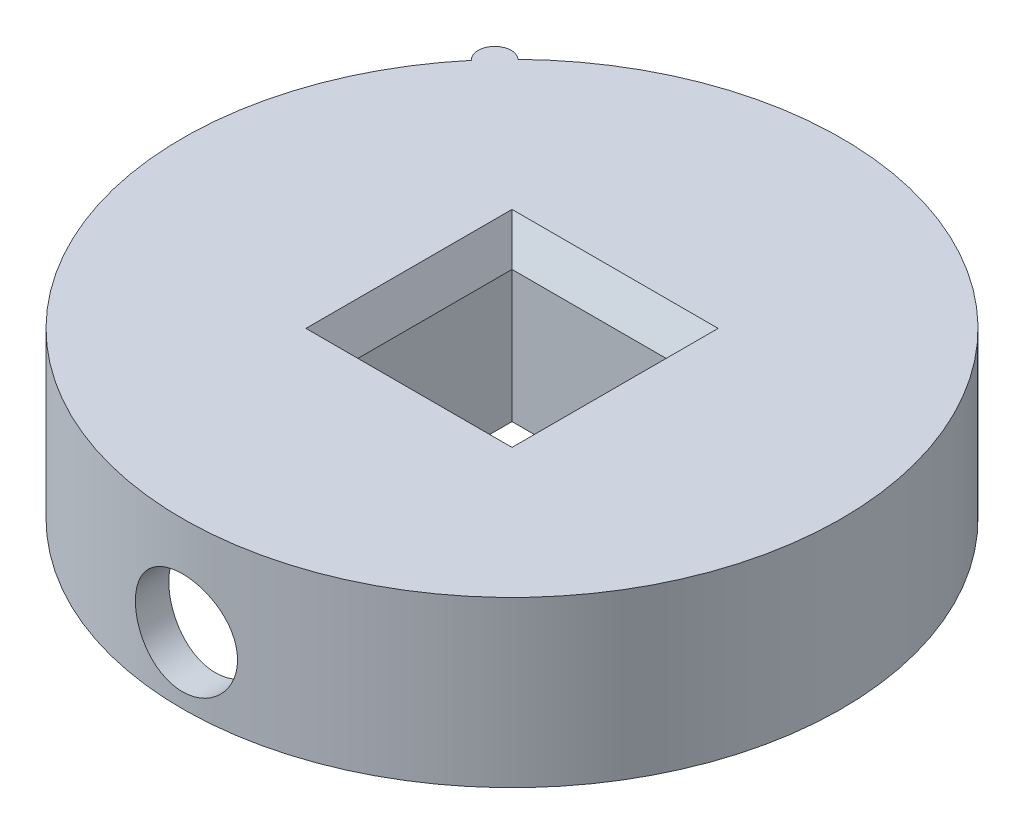
ISO-10303-21;
HEADER;
FILE_DESCRIPTION(('STEP AP214'),'2;1');
FILE_NAME('part.step','',(''),(''),'','','');
FILE_SCHEMA(('AUTOMOTIVE_DESIGN { 1 0 10303 214 1 1 1 1 }'));
ENDSEC;
DATA;
#1=APPLICATION_CONTEXT('core data for automotive mechanical design processes');
#2=APPLICATION_PROTOCOL_DEFINITION('international standard','automotive_design',2000,#1);
#3=PRODUCT_CONTEXT('',#1,'mechanical');
#4=PRODUCT('Part','Part','',(#3));
#5=PRODUCT_RELATED_PRODUCT_CATEGORY('part','',(#4));
#6=PRODUCT_DEFINITION_FORMATION('','',#4);
#7=PRODUCT_DEFINITION_CONTEXT('part definition',#1,'design');
#8=PRODUCT_DEFINITION('design','',#6,#7);
#9=PRODUCT_DEFINITION_SHAPE('','',#8);
#10=(LENGTH_UNIT() NAMED_UNIT(*) SI_UNIT(.MILLI.,.METRE.));
#11=(NAMED_UNIT(*) PLANE_ANGLE_UNIT() SI_UNIT($,.RADIAN.));
#12=(NAMED_UNIT(*) SI_UNIT($,.STERADIAN.) SOLID_ANGLE_UNIT());
#13=UNCERTAINTY_MEASURE_WITH_UNIT(LENGTH_MEASURE(1.E-05),#10,'distance_accuracy_value','');
#14=(GEOMETRIC_REPRESENTATION_CONTEXT(3) GLOBAL_UNCERTAINTY_ASSIGNED_CONTEXT((#13)) GLOBAL_UNIT_ASSIGNED_CONTEXT((#10,
#11,#12)) REPRESENTATION_CONTEXT('',''));
#15=CARTESIAN_POINT('',(0.,0.,0.));
#16=DIRECTION('',(0.,0.,1.));
#17=DIRECTION('',(1.,0.,0.));
#18=AXIS2_PLACEMENT_3D('',#15,#16,#17);
#19=CARTESIAN_POINT('',(0.,10.,0.));
#20=DIRECTION('',(0.,-1.,0.));
#21=DIRECTION('',(0.,0.,-1.));
#22=AXIS2_PLACEMENT_3D('',#19,#20,#21);
#23=CYLINDRICAL_SURFACE('',#22,20.);
#24=CARTESIAN_POINT('',(0.,10.,0.));
#25=DIRECTION('',(0.,1.,0.));
#26=DIRECTION('',(0.,0.,1.));
#27=AXIS2_PLACEMENT_3D('',#24,#25,#26);
#28=CIRCLE('',#27,20.);
#29=CARTESIAN_POINT('',(-15.3208888623795,10.,-12.8557521937308));
#30=VERTEX_POINT('',#29);
#31=CARTESIAN_POINT('',(-13.960317173332,10.,-14.3216460094491));
#32=VERTEX_POINT('',#31);
#33=EDGE_CURVE('E131',#30,#32,#28,.T.);
#34=ORIENTED_EDGE('',*,*,#33,.F.);
#35=DIRECTION('',(0.,1.,0.));
#36=VECTOR('',#35,1.);
#37=CARTESIAN_POINT('',(-15.3208888623796,-2.41380726338418,-12.8557521937307));
#38=LINE('',#37,#36);
#39=CARTESIAN_POINT('',(-15.3208888623796,0.,-12.8557521937307));
#40=VERTEX_POINT('',#39);
#41=EDGE_CURVE('E135',#40,#30,#38,.T.);
#42=ORIENTED_EDGE('',*,*,#41,.F.);
#43=CARTESIAN_POINT('',(0.,0.,0.));
#44=DIRECTION('',(0.,1.,0.));
#45=DIRECTION('',(0.,0.,1.));
#46=AXIS2_PLACEMENT_3D('',#43,#44,#45);
#47=CIRCLE('',#46,20.);
#48=CARTESIAN_POINT('',(-13.960317173332,0.,-14.3216460094491));
#49=VERTEX_POINT('',#48);
#50=EDGE_CURVE('E124',#40,#49,#47,.T.);
#51=ORIENTED_EDGE('',*,*,#50,.T.);
#52=DIRECTION('',(0.,1.,0.));
#53=VECTOR('',#52,1.);
#54=CARTESIAN_POINT('',(-13.9603171733319,-2.41380726338418,-14.3216460094492));
#55=LINE('',#54,#53);
#56=EDGE_CURVE('E141',#49,#32,#55,.T.);
#57=ORIENTED_EDGE('',*,*,#56,.T.);
#58=EDGE_LOOP('',(#34,#42,#51,#57));
#59=FACE_BOUND('',#58,.T.);
#60=CARTESIAN_POINT('',(0.,0.9,20.));
#61=CARTESIAN_POINT('',(0.173016557974578,0.900007080795432,19.9999971650391));
#62=CARTESIAN_POINT('',(0.34613178639695,0.914533455175428,19.9977314078076));
#63=CARTESIAN_POINT('',(0.687518635637837,0.972237701724927,19.9889109487694));
#64=CARTESIAN_POINT('',(0.855785454793477,1.01544302312093,19.9823521380743));
#65=CARTESIAN_POINT('',(1.18248593303596,1.1291791256332,19.9656822285072));
#66=CARTESIAN_POINT('',(1.34092709214203,1.19968875969523,19.9555738792985));
#67=CARTESIAN_POINT('',(1.64370610687182,1.36597920536802,19.9329202594809));
#68=CARTESIAN_POINT('',(1.78804581720928,1.46175668743951,19.9203753099998));
#69=CARTESIAN_POINT('',(2.05974845786461,1.67671260326108,19.8941255745019));
#70=CARTESIAN_POINT('',(2.18697707204052,1.79605986049788,19.8804128527335));
#71=CARTESIAN_POINT('',(2.4196867060257,2.05440416109371,19.85343479463));
#72=CARTESIAN_POINT('',(2.52516644076686,2.19340236474357,19.8401694847697));
#73=CARTESIAN_POINT('',(2.71191152805789,2.48801131649957,19.8155112551125));
#74=CARTESIAN_POINT('',(2.79304608511286,2.64370590555726,19.8041285915852));
#75=CARTESIAN_POINT('',(2.92796168702672,2.96671880338056,19.7846333252768));
#76=CARTESIAN_POINT('',(2.98174432506344,3.13403643448893,19.7765205320398));
#77=CARTESIAN_POINT('',(3.06001047470206,3.47412991875066,19.7645618858971));
#78=CARTESIAN_POINT('',(3.08472451807274,3.64685151766504,19.7606824776643));
#79=CARTESIAN_POINT('',(3.1048662780187,3.99403042740349,19.7575280822113));
#80=CARTESIAN_POINT('',(3.10029578872548,4.16848763124104,19.758252812916));
#81=CARTESIAN_POINT('',(3.06218643754866,4.5125521067266,19.7641941390446));
#82=CARTESIAN_POINT('',(3.02890496858939,4.68218867658666,19.7693708216034));
#83=CARTESIAN_POINT('',(2.93472161326262,5.01344040797057,19.783570384335));
#84=CARTESIAN_POINT('',(2.87381889722358,5.17505532838282,19.7925933800408));
#85=CARTESIAN_POINT('',(2.72585610559503,5.48645559505007,19.8135127113495));
#86=CARTESIAN_POINT('',(2.63868762651754,5.6361886031537,19.8254209140239));
#87=CARTESIAN_POINT('',(2.44074483457386,5.91899998169321,19.8507604280544));
#88=CARTESIAN_POINT('',(2.32996886913798,6.05207718515487,19.8641918460077));
#89=CARTESIAN_POINT('',(2.0865457846287,6.29929060689683,19.8912404778778));
#90=CARTESIAN_POINT('',(1.95367749855783,6.41320911235008,19.9048581429418));
#91=CARTESIAN_POINT('',(1.67059352836411,6.61716458384982,19.9306117241799));
#92=CARTESIAN_POINT('',(1.52037775867124,6.70720143208794,19.9427476330443));
#93=CARTESIAN_POINT('',(1.20666955981141,6.86085145308918,19.9641842572175));
#94=CARTESIAN_POINT('',(1.04316842223976,6.92444712418766,19.973483093561));
#95=CARTESIAN_POINT('',(0.707630368591965,7.02321658476251,19.9881823322231));
#96=CARTESIAN_POINT('',(0.535594070043371,7.05839242726859,19.9935830161389));
#97=CARTESIAN_POINT('',(0.18974745321463,7.09903258858386,19.999839979177));
#98=CARTESIAN_POINT('',(0.0159730895823901,7.10479609111716,20.0007420165939));
#99=CARTESIAN_POINT('',(-0.330059915144203,7.08724310983438,19.9980248327243));
#100=CARTESIAN_POINT('',(-0.5023186062509,7.06392758918426,19.9944057611877));
#101=CARTESIAN_POINT('',(-0.839519062554434,6.98912721291357,19.9830813062526));
#102=CARTESIAN_POINT('',(-1.00449408808775,6.93778880133858,19.9753971727289));
#103=CARTESIAN_POINT('',(-1.32349525981676,6.80855487063498,19.9568011840378));
#104=CARTESIAN_POINT('',(-1.4775208615223,6.73065803193059,19.9458891684944));
#105=CARTESIAN_POINT('',(-1.7715619191957,6.54982138344464,19.9219357385274));
#106=CARTESIAN_POINT('',(-1.91145985994471,6.44669262669295,19.9088785142824));
#107=CARTESIAN_POINT('',(-2.17206987835387,6.21858173575031,19.8821353568535));
#108=CARTESIAN_POINT('',(-2.29278076018428,6.09359824048571,19.8684493845514));
#109=CARTESIAN_POINT('',(-2.51268466926641,5.82399085535137,19.8418452953327));
#110=CARTESIAN_POINT('',(-2.61167667299673,5.67920210042096,19.8289350943909));
#111=CARTESIAN_POINT('',(-2.78393359428538,5.37487547615815,19.805486686096));
#112=CARTESIAN_POINT('',(-2.85719924335206,5.21533802635611,19.7949484113023));
#113=CARTESIAN_POINT('',(-2.97561529141455,4.88663129933381,19.7774949611492));
#114=CARTESIAN_POINT('',(-3.02086981632308,4.71750027657163,19.7705663828432));
#115=CARTESIAN_POINT('',(-3.08230938314147,4.37392249209178,19.7610817453396));
#116=CARTESIAN_POINT('',(-3.09849658118311,4.1994761256275,19.7585253618258));
#117=CARTESIAN_POINT('',(-3.10128813555182,3.85222422779024,19.7580872149381));
#118=CARTESIAN_POINT('',(-3.08820865954259,3.67942121854002,19.7601554912251));
#119=CARTESIAN_POINT('',(-3.03351744801726,3.33850471906413,19.7686247773595));
#120=CARTESIAN_POINT('',(-2.99190577093735,3.17039121923471,19.7750257783332));
#121=CARTESIAN_POINT('',(-2.88144589881863,2.84372354234137,19.791421373363));
#122=CARTESIAN_POINT('',(-2.81262129276619,2.68516122283937,19.801412854401));
#123=CARTESIAN_POINT('',(-2.64972096024408,2.3817828432796,19.8238671717296));
#124=CARTESIAN_POINT('',(-2.55564426248003,2.23696731226727,19.836330103077));
#125=CARTESIAN_POINT('',(-2.34376738116094,1.96358948224111,19.862483054043));
#126=CARTESIAN_POINT('',(-2.22573346513276,1.83520939110733,19.876184362017));
#127=CARTESIAN_POINT('',(-1.96978661876277,1.59996736742,19.903177261943));
#128=CARTESIAN_POINT('',(-1.8318690851942,1.49311043142968,19.9164687581527));
#129=CARTESIAN_POINT('',(-1.53910930505027,1.30338057555414,19.9412344524066));
#130=CARTESIAN_POINT('',(-1.38417199504349,1.22065289513756,19.9526974646132));
#131=CARTESIAN_POINT('',(-1.06249346622742,1.08252095182279,19.9724052696854));
#132=CARTESIAN_POINT('',(-0.895764538907991,1.02708870280286,19.9806533570105));
#133=CARTESIAN_POINT('',(-0.606929877005346,0.957540053066292,19.9911430658503));
#134=CARTESIAN_POINT('',(-0.486597179715198,0.935995962038425,19.9944471586378));
#135=CARTESIAN_POINT('',(-0.244192691603641,0.907223534809589,19.9988766112674));
#136=CARTESIAN_POINT('',(-0.122120924673141,0.899995002135659,20.000002001011));
#137=CARTESIAN_POINT('',(0.,0.9,20.));
#138=B_SPLINE_CURVE_WITH_KNOTS('',3,(#60,#61,#62,#63,#64,#65,#66,#67,#68,#69,#70,#71,#72,#73,
#74,#75,#76,#77,#78,#79,#80,#81,#82,#83,#84,#85,#86,#87,#88,#89,#90,#91,#92,#93,#94,#95,#96,#97,
#98,#99,#100,#101,#102,#103,#104,#105,#106,#107,#108,#109,#110,#111,#112,#113,#114,#115,#116,
#117,#118,#119,#120,#121,#122,#123,#124,#125,#126,#127,#128,#129,#130,#131,#132,#133,#134,#135,
#136,#137),.UNSPECIFIED.,.T.,.F.,(4,2,2,2,2,2,2,2,2,2,2,2,2,2,2,2,2,2,2,2,2,2,2,2,2,2,2,2,2,2,2,
2,2,2,2,2,2,2,4),(0.,0.518603389696483,1.03770386276341,1.55640309660684,2.07503401566504,
2.59752406878385,3.12004498524092,3.64532487300955,4.17057416109137,4.69162919625163,
5.21265230902045,5.72905244255467,6.24546808845431,6.76404496609117,7.28265815704321,
7.80681594553428,8.33097631965123,8.85548309023761,9.3799519674113,9.89907513525496,
10.4181811089692,10.9345999175123,11.4510443884596,11.9714813947096,12.4919508243877,
13.0170514007104,13.5421370450079,14.0652588749373,14.5883418995712,15.105801374666,
15.6232597899663,16.1402706366429,16.6573013724327,17.1796423654186,17.7021044795559,
18.2276494116379,18.7526543724209,19.1187071678768,19.4847549394298),.UNSPECIFIED.);
#139=CARTESIAN_POINT('',(0.,0.9,20.));
#140=VERTEX_POINT('',#139);
#141=EDGE_CURVE('E148',#140,#140,#138,.T.);
#142=ORIENTED_EDGE('',*,*,#141,.F.);
#143=EDGE_LOOP('',(#142));
#144=FACE_BOUND('',#143,.T.);
#145=ADVANCED_FACE('F35',(#59,#144),#23,.T.);
#146=CARTESIAN_POINT('',(0.,10.,0.));
#147=DIRECTION('',(0.,-1.,0.));
#148=DIRECTION('',(0.,0.,-1.));
#149=AXIS2_PLACEMENT_3D('',#146,#147,#148);
#150=CYLINDRICAL_SURFACE('',#149,18.);
#151=CARTESIAN_POINT('',(0.,0.,0.));
#152=DIRECTION('',(0.,1.,0.));
#153=DIRECTION('',(0.,0.,1.));
#154=AXIS2_PLACEMENT_3D('',#151,#152,#153);
#155=CIRCLE('',#154,18.);
#156=CARTESIAN_POINT('',(0.,0.,18.));
#157=VERTEX_POINT('',#156);
#158=EDGE_CURVE('E261',#157,#157,#155,.T.);
#159=ORIENTED_EDGE('',*,*,#158,.F.);
#160=EDGE_LOOP('',(#159));
#161=FACE_BOUND('',#160,.T.);
#162=CARTESIAN_POINT('',(0.,8.,0.));
#163=DIRECTION('',(0.,1.,0.));
#164=DIRECTION('',(0.,0.,1.));
#165=AXIS2_PLACEMENT_3D('',#162,#163,#164);
#166=CIRCLE('',#165,18.);
#167=CARTESIAN_POINT('',(0.,8.,18.));
#168=VERTEX_POINT('',#167);
#169=EDGE_CURVE('E247',#168,#168,#166,.T.);
#170=ORIENTED_EDGE('',*,*,#169,.T.);
#171=EDGE_LOOP('',(#170));
#172=FACE_BOUND('',#171,.T.);
#173=CARTESIAN_POINT('',(-3.1,4.,17.7310462184272));
#174=CARTESIAN_POINT('',(-3.09999313298625,3.82726272069094,17.7310494042664));
#175=CARTESIAN_POINT('',(-3.08551325830219,3.65443324166269,17.73359781963));
#176=CARTESIAN_POINT('',(-3.02800504284677,3.3136297172631,17.7435059787685));
#177=CARTESIAN_POINT('',(-2.98495091441744,3.14566020093493,17.7508700684992));
#178=CARTESIAN_POINT('',(-2.87164044523443,2.81955782532416,17.7695513490921));
#179=CARTESIAN_POINT('',(-2.80140750244069,2.66141664047294,17.7808651388806));
#180=CARTESIAN_POINT('',(-2.63579233362493,2.35917772393653,17.8061670210701));
#181=CARTESIAN_POINT('',(-2.54041271452993,2.21507853865303,17.8201548362166));
#182=CARTESIAN_POINT('',(-2.32614184855305,1.94348302334085,17.8493930596395));
#183=CARTESIAN_POINT('',(-2.20703766109128,1.81615581205768,17.8646541168498));
#184=CARTESIAN_POINT('',(-1.94915880252542,1.58318869594025,17.8946248323828));
#185=CARTESIAN_POINT('',(-1.8103829352717,1.47755011085444,17.9093344571066));
#186=CARTESIAN_POINT('',(-1.51600028932563,1.29032070282335,17.936657998033));
#187=CARTESIAN_POINT('',(-1.36029165213239,1.20888781717709,17.9492579257511));
#188=CARTESIAN_POINT('',(-1.03715174208675,1.07339715212286,17.9708237164532));
#189=CARTESIAN_POINT('',(-0.869721283594248,1.01933747313718,17.979789831599));
#190=CARTESIAN_POINT('',(-0.529639199316319,0.94064653169822,17.9930025721505));
#191=CARTESIAN_POINT('',(-0.35705518468448,0.91573085034474,17.9972947816215));
#192=CARTESIAN_POINT('',(-0.0101065543135215,0.89515029007298,18.0008328399529));
#193=CARTESIAN_POINT('',(0.164257931654621,0.899483294323953,18.0000790540098));
#194=CARTESIAN_POINT('',(0.507871793120614,0.9370562397458,17.9936460189792));
#195=CARTESIAN_POINT('',(0.677155759346085,0.969990051732044,17.988018933082));
#196=CARTESIAN_POINT('',(1.00775822133334,1.06334715589263,17.9725297958012));
#197=CARTESIAN_POINT('',(1.16907646161652,1.12377132911018,17.9626676086866));
#198=CARTESIAN_POINT('',(1.48007290317722,1.27069494452743,17.9397279725034));
#199=CARTESIAN_POINT('',(1.62969078748866,1.35731956202935,17.9266351452942));
#200=CARTESIAN_POINT('',(1.91238214853264,1.5540932748335,17.898687174683));
#201=CARTESIAN_POINT('',(2.04545419633083,1.66424439970646,17.8838318792866));
#202=CARTESIAN_POINT('',(2.29308650989974,1.90663949916695,17.8537823097114));
#203=CARTESIAN_POINT('',(2.40738472323858,2.03915111084635,17.838586137045));
#204=CARTESIAN_POINT('',(2.61216854846296,2.32160652946511,17.8097530244593));
#205=CARTESIAN_POINT('',(2.70265391082531,2.47155051904609,17.7961161008794));
#206=CARTESIAN_POINT('',(2.85730087370296,2.78492932747192,17.7719440497841));
#207=CARTESIAN_POINT('',(2.92142926062609,2.94838085830812,17.7614128406061));
#208=CARTESIAN_POINT('',(3.02124489556565,3.28395857625857,17.7447080955585));
#209=CARTESIAN_POINT('',(3.05693482896464,3.45608394268864,17.7385341482481));
#210=CARTESIAN_POINT('',(3.09848798719902,3.80177395904009,17.7313230529256));
#211=CARTESIAN_POINT('',(3.10472551762942,3.9752923138647,17.7302214459032));
#212=CARTESIAN_POINT('',(3.08819578605888,4.32089297696119,17.7331078649149));
#213=CARTESIAN_POINT('',(3.06542972381246,4.49297534433735,17.7370956804214));
#214=CARTESIAN_POINT('',(2.99185875873464,4.82961966631278,17.7496519386929));
#215=CARTESIAN_POINT('',(2.94124583341696,4.99422485025197,17.7581890061732));
#216=CARTESIAN_POINT('',(2.81361979825464,5.31261748550005,17.7788553503244));
#217=CARTESIAN_POINT('',(2.73660501354011,5.46640424976855,17.7909848548842));
#218=CARTESIAN_POINT('',(2.55748363807944,5.76045617285387,17.8176183967342));
#219=CARTESIAN_POINT('',(2.45513805299021,5.90057370577815,17.8321445840279));
#220=CARTESIAN_POINT('',(2.22858683964253,6.16178043077467,17.8618706165594));
#221=CARTESIAN_POINT('',(2.10437956531447,6.28286818870502,17.8770705124594));
#222=CARTESIAN_POINT('',(1.83596895921044,6.50395300395085,17.9066360445248));
#223=CARTESIAN_POINT('',(1.6915581469289,6.60369989266837,17.9209904913054));
#224=CARTESIAN_POINT('',(1.38781145578617,6.77751584823228,17.9470660891861));
#225=CARTESIAN_POINT('',(1.2284760847549,6.8515857883715,17.9587873298389));
#226=CARTESIAN_POINT('',(0.900133060857951,6.97155973486499,17.9782273472964));
#227=CARTESIAN_POINT('',(0.731173614747658,7.0175925824532,17.9859644071876));
#228=CARTESIAN_POINT('',(0.387777506000827,7.08059964069153,17.996641785183));
#229=CARTESIAN_POINT('',(0.213341327330556,7.09757641164158,17.9995825259176));
#230=CARTESIAN_POINT('',(-0.133646085689154,7.10191176659875,18.0003293291214));
#231=CARTESIAN_POINT('',(-0.306192548851938,7.08965025784471,17.9982012535989));
#232=CARTESIAN_POINT('',(-0.646729000742405,7.03668147658913,17.9891845992446));
#233=CARTESIAN_POINT('',(-0.814719019304073,6.99597439038589,17.9822960515906));
#234=CARTESIAN_POINT('',(-1.14121455109152,6.88741952012266,17.9645302874585));
#235=CARTESIAN_POINT('',(-1.29973179471327,6.81960613815113,17.9536581282528));
#236=CARTESIAN_POINT('',(-1.60319648346798,6.65880671706889,17.9291094270097));
#237=CARTESIAN_POINT('',(-1.74814321499517,6.5658193551832,17.9154327376165));
#238=CARTESIAN_POINT('',(-2.02226104621523,6.35597463562083,17.8865791500137));
#239=CARTESIAN_POINT('',(-2.1512181870935,6.23883999122012,17.8713859895924));
#240=CARTESIAN_POINT('',(-2.38777968814283,5.98460626618822,17.8413218089942));
#241=CARTESIAN_POINT('',(-2.49537903835792,5.84750251439415,17.8264508651275));
#242=CARTESIAN_POINT('',(-2.68692820643402,5.55598003634335,17.7985921888736));
#243=CARTESIAN_POINT('',(-2.77069172773889,5.40143742750927,17.7856196566342));
#244=CARTESIAN_POINT('',(-2.91093883284905,5.08031080000741,17.7632069636885));
#245=CARTESIAN_POINT('',(-2.96744928842572,4.9137388295448,17.7537633255382));
#246=CARTESIAN_POINT('',(-3.03951297941637,4.62213034763268,17.7415403224668));
#247=CARTESIAN_POINT('',(-3.06215859815304,4.49884552094047,17.7376272886697));
#248=CARTESIAN_POINT('',(-3.09240444505106,4.25038992086438,17.7323791080338));
#249=CARTESIAN_POINT('',(-3.10000497797507,4.12521918573439,17.7310439089767));
#250=CARTESIAN_POINT('',(-3.1,4.,17.7310462184272));
#251=B_SPLINE_CURVE_WITH_KNOTS('',3,(#173,#174,#175,#176,#177,#178,#179,#180,#181,#182,#183,
#184,#185,#186,#187,#188,#189,#190,#191,#192,#193,#194,#195,#196,#197,#198,#199,#200,#201,#202,
#203,#204,#205,#206,#207,#208,#209,#210,#211,#212,#213,#214,#215,#216,#217,#218,#219,#220,#221,
#222,#223,#224,#225,#226,#227,#228,#229,#230,#231,#232,#233,#234,#235,#236,#237,#238,#239,#240,
#241,#242,#243,#244,#245,#246,#247,#248,#249,#250),.UNSPECIFIED.,.T.,.F.,(4,2,2,2,2,2,2,2,2,2,2,
2,2,2,2,2,2,2,2,2,2,2,2,2,2,2,2,2,2,2,2,2,2,2,2,2,2,2,4),(0.,0.517753850761574,1.03597559993478,
1.55375220630103,2.07147515645401,2.59407326128228,3.11670315667935,3.64267180628803,
4.16860395102849,4.68935948381991,5.21007732809709,5.72528941141336,6.24051800801167,
6.75824812295139,7.27602291917712,7.80050309565845,8.32498876769148,8.85013335577677,
9.37522834969941,9.89363170722258,10.4120136213134,10.9268657713359,11.4417505883749,
11.961692000747,12.4816725787187,13.0074499206043,13.5332093786423,14.0565341726182,
14.5798128510276,15.0963294394443,15.6128426450766,16.128702386328,16.6445892388609,
17.1667678336015,17.6890687728398,18.2153463288493,18.7411039040315,19.1164370642766,
19.4917626214611),.UNSPECIFIED.);
#252=CARTESIAN_POINT('',(-3.1,4.,17.7310462184272));
#253=VERTEX_POINT('',#252);
#254=EDGE_CURVE('E145',#253,#253,#251,.T.);
#255=ORIENTED_EDGE('',*,*,#254,.T.);
#256=EDGE_LOOP('',(#255));
#257=FACE_BOUND('',#256,.T.);
#258=ADVANCED_FACE('F161',(#161,#172,#257),#150,.F.);
#259=CARTESIAN_POINT('',(0.,0.,0.));
#260=DIRECTION('',(0.,1.,0.));
#261=DIRECTION('',(0.,0.,1.));
#262=AXIS2_PLACEMENT_3D('',#259,#260,#261);
#263=PLANE('',#262);
#264=DIRECTION('',(0.,0.,-1.));
#265=VECTOR('',#264,1.);
#266=CARTESIAN_POINT('',(-7.1,0.,5.1));
#267=LINE('',#266,#265);
#268=CARTESIAN_POINT('',(-7.1,0.,7.1));
#269=VERTEX_POINT('',#268);
#270=CARTESIAN_POINT('',(-7.1,0.,-7.1));
#271=VERTEX_POINT('',#270);
#272=EDGE_CURVE('E252',#269,#271,#267,.T.);
#273=ORIENTED_EDGE('',*,*,#272,.T.);
#274=DIRECTION('',(1.,0.,0.));
#275=VECTOR('',#274,1.);
#276=CARTESIAN_POINT('',(5.1,0.,-7.1));
#277=LINE('',#276,#275);
#278=CARTESIAN_POINT('',(7.1,0.,-7.1));
#279=VERTEX_POINT('',#278);
#280=EDGE_CURVE('E248',#271,#279,#277,.T.);
#281=ORIENTED_EDGE('',*,*,#280,.T.);
#282=DIRECTION('',(0.,0.,1.));
#283=VECTOR('',#282,1.);
#284=CARTESIAN_POINT('',(7.1,0.,5.1));
#285=LINE('',#284,#283);
#286=CARTESIAN_POINT('',(7.1,0.,7.1));
#287=VERTEX_POINT('',#286);
#288=EDGE_CURVE('E251',#279,#287,#285,.T.);
#289=ORIENTED_EDGE('',*,*,#288,.T.);
#290=DIRECTION('',(-1.,0.,0.));
#291=VECTOR('',#290,1.);
#292=CARTESIAN_POINT('',(5.1,0.,7.1));
#293=LINE('',#292,#291);
#294=EDGE_CURVE('E255',#287,#269,#293,.T.);
#295=ORIENTED_EDGE('',*,*,#294,.T.);
#296=EDGE_LOOP('',(#273,#281,#289,#295));
#297=FACE_BOUND('',#296,.T.);
#298=DIRECTION('',(1.,0.,0.));
#299=VECTOR('',#298,1.);
#300=CARTESIAN_POINT('',(5.1,0.,-5.1));
#301=LINE('',#300,#299);
#302=CARTESIAN_POINT('',(-5.1,0.,-5.1));
#303=VERTEX_POINT('',#302);
#304=CARTESIAN_POINT('',(5.1,0.,-5.1));
#305=VERTEX_POINT('',#304);
#306=EDGE_CURVE('E241',#303,#305,#301,.T.);
#307=ORIENTED_EDGE('',*,*,#306,.F.);
#308=DIRECTION('',(0.,0.,-1.));
#309=VECTOR('',#308,1.);
#310=CARTESIAN_POINT('',(-5.1,0.,5.1));
#311=LINE('',#310,#309);
#312=CARTESIAN_POINT('',(-5.1,0.,5.1));
#313=VERTEX_POINT('',#312);
#314=EDGE_CURVE('E244',#313,#303,#311,.T.);
#315=ORIENTED_EDGE('',*,*,#314,.F.);
#316=DIRECTION('',(-1.,0.,0.));
#317=VECTOR('',#316,1.);
#318=CARTESIAN_POINT('',(5.1,0.,5.1));
#319=LINE('',#318,#317);
#320=CARTESIAN_POINT('',(5.1,0.,5.1));
#321=VERTEX_POINT('',#320);
#322=EDGE_CURVE('E231',#321,#313,#319,.T.);
#323=ORIENTED_EDGE('',*,*,#322,.F.);
#324=DIRECTION('',(0.,0.,1.));
#325=VECTOR('',#324,1.);
#326=CARTESIAN_POINT('',(5.1,0.,5.1));
#327=LINE('',#326,#325);
#328=EDGE_CURVE('E238',#305,#321,#327,.T.);
#329=ORIENTED_EDGE('',*,*,#328,.F.);
#330=EDGE_LOOP('',(#307,#315,#323,#329));
#331=FACE_BOUND('',#330,.T.);
#332=ADVANCED_FACE('F181',(#297,#331),#263,.F.);
#333=CARTESIAN_POINT('',(0.,10.,0.));
#334=DIRECTION('',(0.,1.,0.));
#335=DIRECTION('',(0.,0.,1.));
#336=AXIS2_PLACEMENT_3D('',#333,#334,#335);
#337=PLANE('',#336);
#338=DIRECTION('',(-1.,0.,0.));
#339=VECTOR('',#338,1.);
#340=CARTESIAN_POINT('',(-5.1,10.,6.25470053837925));
#341=LINE('',#340,#339);
#342=CARTESIAN_POINT('',(6.25470053837925,10.,6.25470053837925));
#343=VERTEX_POINT('',#342);
#344=CARTESIAN_POINT('',(-6.25470053837925,10.,6.25470053837925));
#345=VERTEX_POINT('',#344);
#346=EDGE_CURVE('E203',#343,#345,#341,.T.);
#347=ORIENTED_EDGE('',*,*,#346,.T.);
#348=DIRECTION('',(0.,0.,-1.));
#349=VECTOR('',#348,1.);
#350=CARTESIAN_POINT('',(-6.25470053837925,10.,-5.1));
#351=LINE('',#350,#349);
#352=CARTESIAN_POINT('',(-6.25470053837925,10.,-6.25470053837925));
#353=VERTEX_POINT('',#352);
#354=EDGE_CURVE('E219',#345,#353,#351,.T.);
#355=ORIENTED_EDGE('',*,*,#354,.T.);
#356=DIRECTION('',(1.,0.,0.));
#357=VECTOR('',#356,1.);
#358=CARTESIAN_POINT('',(5.1,10.,-6.25470053837925));
#359=LINE('',#358,#357);
#360=CARTESIAN_POINT('',(6.25470053837925,10.,-6.25470053837925));
#361=VERTEX_POINT('',#360);
#362=EDGE_CURVE('E225',#353,#361,#359,.T.);
#363=ORIENTED_EDGE('',*,*,#362,.T.);
#364=DIRECTION('',(0.,0.,1.));
#365=VECTOR('',#364,1.);
#366=CARTESIAN_POINT('',(6.25470053837925,10.,5.1));
#367=LINE('',#366,#365);
#368=EDGE_CURVE('E223',#361,#343,#367,.T.);
#369=ORIENTED_EDGE('',*,*,#368,.T.);
#370=EDGE_LOOP('',(#347,#355,#363,#369));
#371=FACE_BOUND('',#370,.T.);
#372=ORIENTED_EDGE('',*,*,#33,.T.);
#373=CARTESIAN_POINT('',(-14.6406030178558,10.,-13.58869910159));
#374=DIRECTION('',(0.,1.,0.));
#375=DIRECTION('',(0.,0.,-1.));
#376=AXIS2_PLACEMENT_3D('',#373,#374,#375);
#377=CIRCLE('',#376,1.);
#378=EDGE_CURVE('E142',#32,#30,#377,.T.);
#379=ORIENTED_EDGE('',*,*,#378,.T.);
#380=EDGE_LOOP('',(#372,#379));
#381=FACE_BOUND('',#380,.T.);
#382=ADVANCED_FACE('F323',(#371,#381),#337,.T.);
#383=ORIENTED_EDGE('',*,*,#158,.T.);
#384=EDGE_LOOP('',(#383));
#385=FACE_BOUND('',#384,.T.);
#386=ORIENTED_EDGE('',*,*,#50,.F.);
#387=CARTESIAN_POINT('',(-14.6406030178558,0.,-13.58869910159));
#388=DIRECTION('',(0.,1.,0.));
#389=DIRECTION('',(0.,0.,1.));
#390=AXIS2_PLACEMENT_3D('',#387,#388,#389);
#391=CIRCLE('',#390,1.);
#392=EDGE_CURVE('E128',#40,#49,#391,.F.);
#393=ORIENTED_EDGE('',*,*,#392,.T.);
#394=EDGE_LOOP('',(#386,#393));
#395=FACE_BOUND('',#394,.T.);
#396=ADVANCED_FACE('F126',(#385,#395),#263,.F.);
#397=CARTESIAN_POINT('',(-5.1,10.,5.1));
#398=DIRECTION('',(-1.,0.,0.));
#399=DIRECTION('',(0.,0.,1.));
#400=AXIS2_PLACEMENT_3D('',#397,#398,#399);
#401=PLANE('',#400);
#402=DIRECTION('',(0.,-1.,0.));
#403=VECTOR('',#402,1.);
#404=CARTESIAN_POINT('',(-5.1,10.,-5.1));
#405=LINE('',#404,#403);
#406=CARTESIAN_POINT('',(-5.1,7.99999999999999,-5.1));
#407=VERTEX_POINT('',#406);
#408=EDGE_CURVE('E228',#407,#303,#405,.T.);
#409=ORIENTED_EDGE('',*,*,#408,.F.);
#410=DIRECTION('',(0.,0.,1.));
#411=VECTOR('',#410,1.);
#412=CARTESIAN_POINT('',(-5.1,7.99999999999999,5.1));
#413=LINE('',#412,#411);
#414=CARTESIAN_POINT('',(-5.1,7.99999999999999,5.1));
#415=VERTEX_POINT('',#414);
#416=EDGE_CURVE('E217',#407,#415,#413,.T.);
#417=ORIENTED_EDGE('',*,*,#416,.T.);
#418=DIRECTION('',(0.,-1.,0.));
#419=VECTOR('',#418,1.);
#420=CARTESIAN_POINT('',(-5.1,10.,5.1));
#421=LINE('',#420,#419);
#422=EDGE_CURVE('E132',#415,#313,#421,.T.);
#423=ORIENTED_EDGE('',*,*,#422,.T.);
#424=ORIENTED_EDGE('',*,*,#314,.T.);
#425=EDGE_LOOP('',(#409,#417,#423,#424));
#426=FACE_BOUND('',#425,.T.);
#427=ADVANCED_FACE('F318',(#426),#401,.F.);
#428=CARTESIAN_POINT('',(5.1,10.,5.1));
#429=DIRECTION('',(0.,0.,1.));
#430=DIRECTION('',(1.,0.,0.));
#431=AXIS2_PLACEMENT_3D('',#428,#429,#430);
#432=PLANE('',#431);
#433=ORIENTED_EDGE('',*,*,#422,.F.);
#434=DIRECTION('',(1.,0.,0.));
#435=VECTOR('',#434,1.);
#436=CARTESIAN_POINT('',(5.1,7.99999999999999,5.1));
#437=LINE('',#436,#435);
#438=CARTESIAN_POINT('',(5.1,7.99999999999999,5.1));
#439=VERTEX_POINT('',#438);
#440=EDGE_CURVE('E59',#415,#439,#437,.T.);
#441=ORIENTED_EDGE('',*,*,#440,.T.);
#442=DIRECTION('',(0.,-1.,0.));
#443=VECTOR('',#442,1.);
#444=CARTESIAN_POINT('',(5.1,10.,5.1));
#445=LINE('',#444,#443);
#446=EDGE_CURVE('E233',#439,#321,#445,.T.);
#447=ORIENTED_EDGE('',*,*,#446,.T.);
#448=ORIENTED_EDGE('',*,*,#322,.T.);
#449=EDGE_LOOP('',(#433,#441,#447,#448));
#450=FACE_BOUND('',#449,.T.);
#451=ADVANCED_FACE('F315',(#450),#432,.F.);
#452=CARTESIAN_POINT('',(5.1,10.,5.1));
#453=DIRECTION('',(1.,0.,0.));
#454=DIRECTION('',(0.,0.,-1.));
#455=AXIS2_PLACEMENT_3D('',#452,#453,#454);
#456=PLANE('',#455);
#457=ORIENTED_EDGE('',*,*,#446,.F.);
#458=DIRECTION('',(0.,0.,-1.));
#459=VECTOR('',#458,1.);
#460=CARTESIAN_POINT('',(5.1,7.99999999999999,-5.1));
#461=LINE('',#460,#459);
#462=CARTESIAN_POINT('',(5.1,7.99999999999999,-5.1));
#463=VERTEX_POINT('',#462);
#464=EDGE_CURVE('E44',#439,#463,#461,.T.);
#465=ORIENTED_EDGE('',*,*,#464,.T.);
#466=DIRECTION('',(0.,-1.,0.));
#467=VECTOR('',#466,1.);
#468=CARTESIAN_POINT('',(5.1,10.,-5.1));
#469=LINE('',#468,#467);
#470=EDGE_CURVE('E230',#463,#305,#469,.T.);
#471=ORIENTED_EDGE('',*,*,#470,.T.);
#472=ORIENTED_EDGE('',*,*,#328,.T.);
#473=EDGE_LOOP('',(#457,#465,#471,#472));
#474=FACE_BOUND('',#473,.T.);
#475=ADVANCED_FACE('F300',(#474),#456,.F.);
#476=CARTESIAN_POINT('',(5.1,10.,-5.1));
#477=DIRECTION('',(0.,0.,-1.));
#478=DIRECTION('',(-1.,0.,0.));
#479=AXIS2_PLACEMENT_3D('',#476,#477,#478);
#480=PLANE('',#479);
#481=ORIENTED_EDGE('',*,*,#470,.F.);
#482=DIRECTION('',(-1.,0.,0.));
#483=VECTOR('',#482,1.);
#484=CARTESIAN_POINT('',(-5.1,7.99999999999999,-5.1));
#485=LINE('',#484,#483);
#486=EDGE_CURVE('E11',#463,#407,#485,.T.);
#487=ORIENTED_EDGE('',*,*,#486,.T.);
#488=ORIENTED_EDGE('',*,*,#408,.T.);
#489=ORIENTED_EDGE('',*,*,#306,.T.);
#490=EDGE_LOOP('',(#481,#487,#488,#489));
#491=FACE_BOUND('',#490,.T.);
#492=ADVANCED_FACE('F291',(#491),#480,.F.);
#493=CARTESIAN_POINT('',(0.,8.,0.));
#494=DIRECTION('',(0.,1.,0.));
#495=DIRECTION('',(0.,0.,1.));
#496=AXIS2_PLACEMENT_3D('',#493,#494,#495);
#497=PLANE('',#496);
#498=DIRECTION('',(0.,0.,-1.));
#499=VECTOR('',#498,1.);
#500=CARTESIAN_POINT('',(-7.1,8.,5.1));
#501=LINE('',#500,#499);
#502=CARTESIAN_POINT('',(-7.1,8.,7.1));
#503=VERTEX_POINT('',#502);
#504=CARTESIAN_POINT('',(-7.1,8.,-7.1));
#505=VERTEX_POINT('',#504);
#506=EDGE_CURVE('E258',#503,#505,#501,.T.);
#507=ORIENTED_EDGE('',*,*,#506,.F.);
#508=DIRECTION('',(-1.,0.,0.));
#509=VECTOR('',#508,1.);
#510=CARTESIAN_POINT('',(5.1,8.,7.1));
#511=LINE('',#510,#509);
#512=CARTESIAN_POINT('',(7.1,8.,7.1));
#513=VERTEX_POINT('',#512);
#514=EDGE_CURVE('E273',#513,#503,#511,.T.);
#515=ORIENTED_EDGE('',*,*,#514,.F.);
#516=DIRECTION('',(0.,0.,1.));
#517=VECTOR('',#516,1.);
#518=CARTESIAN_POINT('',(7.1,8.,5.1));
#519=LINE('',#518,#517);
#520=CARTESIAN_POINT('',(7.1,8.,-7.1));
#521=VERTEX_POINT('',#520);
#522=EDGE_CURVE('E276',#521,#513,#519,.T.);
#523=ORIENTED_EDGE('',*,*,#522,.F.);
#524=DIRECTION('',(1.,0.,0.));
#525=VECTOR('',#524,1.);
#526=CARTESIAN_POINT('',(5.1,8.,-7.1));
#527=LINE('',#526,#525);
#528=EDGE_CURVE('E279',#505,#521,#527,.T.);
#529=ORIENTED_EDGE('',*,*,#528,.F.);
#530=EDGE_LOOP('',(#507,#515,#523,#529));
#531=FACE_BOUND('',#530,.T.);
#532=ORIENTED_EDGE('',*,*,#169,.F.);
#533=EDGE_LOOP('',(#532));
#534=FACE_BOUND('',#533,.T.);
#535=ADVANCED_FACE('F288',(#531,#534),#497,.F.);
#536=CARTESIAN_POINT('',(-7.1,10.,5.1));
#537=DIRECTION('',(-1.,0.,0.));
#538=DIRECTION('',(0.,0.,1.));
#539=AXIS2_PLACEMENT_3D('',#536,#537,#538);
#540=PLANE('',#539);
#541=ORIENTED_EDGE('',*,*,#272,.F.);
#542=DIRECTION('',(0.,-1.,0.));
#543=VECTOR('',#542,1.);
#544=CARTESIAN_POINT('',(-7.1,10.,7.1));
#545=LINE('',#544,#543);
#546=EDGE_CURVE('E264',#503,#269,#545,.T.);
#547=ORIENTED_EDGE('',*,*,#546,.F.);
#548=ORIENTED_EDGE('',*,*,#506,.T.);
#549=DIRECTION('',(0.,-1.,0.));
#550=VECTOR('',#549,1.);
#551=CARTESIAN_POINT('',(-7.1,10.,-7.1));
#552=LINE('',#551,#550);
#553=EDGE_CURVE('E268',#505,#271,#552,.T.);
#554=ORIENTED_EDGE('',*,*,#553,.T.);
#555=EDGE_LOOP('',(#541,#547,#548,#554));
#556=FACE_BOUND('',#555,.T.);
#557=ADVANCED_FACE('F290',(#556),#540,.T.);
#558=CARTESIAN_POINT('',(5.1,10.,7.1));
#559=DIRECTION('',(0.,0.,1.));
#560=DIRECTION('',(1.,0.,0.));
#561=AXIS2_PLACEMENT_3D('',#558,#559,#560);
#562=PLANE('',#561);
#563=ORIENTED_EDGE('',*,*,#294,.F.);
#564=DIRECTION('',(0.,-1.,0.));
#565=VECTOR('',#564,1.);
#566=CARTESIAN_POINT('',(7.1,10.,7.1));
#567=LINE('',#566,#565);
#568=EDGE_CURVE('E267',#513,#287,#567,.T.);
#569=ORIENTED_EDGE('',*,*,#568,.F.);
#570=ORIENTED_EDGE('',*,*,#514,.T.);
#571=ORIENTED_EDGE('',*,*,#546,.T.);
#572=EDGE_LOOP('',(#563,#569,#570,#571));
#573=FACE_BOUND('',#572,.T.);
#574=ADVANCED_FACE('F297',(#573),#562,.T.);
#575=CARTESIAN_POINT('',(7.1,10.,5.1));
#576=DIRECTION('',(1.,0.,0.));
#577=DIRECTION('',(0.,0.,-1.));
#578=AXIS2_PLACEMENT_3D('',#575,#576,#577);
#579=PLANE('',#578);
#580=ORIENTED_EDGE('',*,*,#288,.F.);
#581=DIRECTION('',(0.,-1.,0.));
#582=VECTOR('',#581,1.);
#583=CARTESIAN_POINT('',(7.1,10.,-7.1));
#584=LINE('',#583,#582);
#585=EDGE_CURVE('E265',#521,#279,#584,.T.);
#586=ORIENTED_EDGE('',*,*,#585,.F.);
#587=ORIENTED_EDGE('',*,*,#522,.T.);
#588=ORIENTED_EDGE('',*,*,#568,.T.);
#589=EDGE_LOOP('',(#580,#586,#587,#588));
#590=FACE_BOUND('',#589,.T.);
#591=ADVANCED_FACE('F307',(#590),#579,.T.);
#592=CARTESIAN_POINT('',(5.1,10.,-7.1));
#593=DIRECTION('',(0.,0.,-1.));
#594=DIRECTION('',(-1.,0.,0.));
#595=AXIS2_PLACEMENT_3D('',#592,#593,#594);
#596=PLANE('',#595);
#597=ORIENTED_EDGE('',*,*,#280,.F.);
#598=ORIENTED_EDGE('',*,*,#553,.F.);
#599=ORIENTED_EDGE('',*,*,#528,.T.);
#600=ORIENTED_EDGE('',*,*,#585,.T.);
#601=EDGE_LOOP('',(#597,#598,#599,#600));
#602=FACE_BOUND('',#601,.T.);
#603=ADVANCED_FACE('F168',(#602),#596,.T.);
#604=CARTESIAN_POINT('',(0.,4.,20.));
#605=DIRECTION('',(0.,0.,-1.));
#606=DIRECTION('',(-1.,0.,0.));
#607=AXIS2_PLACEMENT_3D('',#604,#605,#606);
#608=CYLINDRICAL_SURFACE('',#607,3.1);
#609=ORIENTED_EDGE('',*,*,#254,.F.);
#610=EDGE_LOOP('',(#609));
#611=FACE_BOUND('',#610,.T.);
#612=ORIENTED_EDGE('',*,*,#141,.T.);
#613=EDGE_LOOP('',(#612));
#614=FACE_BOUND('',#613,.T.);
#615=ADVANCED_FACE('F164',(#611,#614),#608,.F.);
#616=CARTESIAN_POINT('',(-14.6406030178558,-2.41380726338418,-13.58869910159));
#617=DIRECTION('',(0.,1.,0.));
#618=DIRECTION('',(0.,0.,1.));
#619=AXIS2_PLACEMENT_3D('',#616,#617,#618);
#620=CYLINDRICAL_SURFACE('',#619,1.);
#621=ORIENTED_EDGE('',*,*,#392,.F.);
#622=ORIENTED_EDGE('',*,*,#41,.T.);
#623=ORIENTED_EDGE('',*,*,#378,.F.);
#624=ORIENTED_EDGE('',*,*,#56,.F.);
#625=EDGE_LOOP('',(#621,#622,#623,#624));
#626=FACE_BOUND('',#625,.T.);
#627=ADVANCED_FACE('F144',(#626),#620,.T.);
#628=CARTESIAN_POINT('',(6.25470053837925,10.,0.));
#629=DIRECTION('',(-0.866025403784439,0.499999999999999,0.));
#630=DIRECTION('',(0.,0.,-1.));
#631=AXIS2_PLACEMENT_3D('',#628,#629,#630);
#632=PLANE('',#631);
#633=DIRECTION('',(0.447213595499957,0.774596669241485,-0.447213595499957));
#634=VECTOR('',#633,1.);
#635=CARTESIAN_POINT('',(5.00376043070341,7.83330817627975,-5.00376043070341));
#636=LINE('',#635,#634);
#637=EDGE_CURVE('E205',#463,#361,#636,.T.);
#638=ORIENTED_EDGE('',*,*,#637,.F.);
#639=ORIENTED_EDGE('',*,*,#464,.F.);
#640=DIRECTION('',(0.447213595499957,0.774596669241484,0.447213595499957));
#641=VECTOR('',#640,1.);
#642=CARTESIAN_POINT('',(5.0037604307034,7.83330817627975,5.00376043070341));
#643=LINE('',#642,#641);
#644=EDGE_CURVE('E39',#343,#439,#643,.F.);
#645=ORIENTED_EDGE('',*,*,#644,.F.);
#646=ORIENTED_EDGE('',*,*,#368,.F.);
#647=EDGE_LOOP('',(#638,#639,#645,#646));
#648=FACE_BOUND('',#647,.T.);
#649=ADVANCED_FACE('F37',(#648),#632,.T.);
#650=CARTESIAN_POINT('',(0.,10.,6.25470053837925));
#651=DIRECTION('',(0.,0.499999999999999,-0.866025403784439));
#652=DIRECTION('',(1.,0.,0.));
#653=AXIS2_PLACEMENT_3D('',#650,#651,#652);
#654=PLANE('',#653);
#655=ORIENTED_EDGE('',*,*,#644,.T.);
#656=ORIENTED_EDGE('',*,*,#440,.F.);
#657=DIRECTION('',(-0.447213595499957,0.774596669241485,0.447213595499957));
#658=VECTOR('',#657,1.);
#659=CARTESIAN_POINT('',(-5.00376043070341,7.83330817627975,5.00376043070341));
#660=LINE('',#659,#658);
#661=EDGE_CURVE('E207',#345,#415,#660,.F.);
#662=ORIENTED_EDGE('',*,*,#661,.F.);
#663=ORIENTED_EDGE('',*,*,#346,.F.);
#664=EDGE_LOOP('',(#655,#656,#662,#663));
#665=FACE_BOUND('',#664,.T.);
#666=ADVANCED_FACE('F175',(#665),#654,.T.);
#667=CARTESIAN_POINT('',(0.,10.,-6.25470053837925));
#668=DIRECTION('',(0.,0.499999999999999,0.866025403784439));
#669=DIRECTION('',(-1.,0.,0.));
#670=AXIS2_PLACEMENT_3D('',#667,#668,#669);
#671=PLANE('',#670);
#672=ORIENTED_EDGE('',*,*,#637,.T.);
#673=ORIENTED_EDGE('',*,*,#362,.F.);
#674=DIRECTION('',(0.447213595499957,-0.774596669241485,0.447213595499957));
#675=VECTOR('',#674,1.);
#676=CARTESIAN_POINT('',(-5.00376043070341,7.83330817627975,-5.00376043070341));
#677=LINE('',#676,#675);
#678=EDGE_CURVE('E211',#407,#353,#677,.F.);
#679=ORIENTED_EDGE('',*,*,#678,.F.);
#680=ORIENTED_EDGE('',*,*,#486,.F.);
#681=EDGE_LOOP('',(#672,#673,#679,#680));
#682=FACE_BOUND('',#681,.T.);
#683=ADVANCED_FACE('F190',(#682),#671,.T.);
#684=CARTESIAN_POINT('',(-6.25470053837925,10.,0.));
#685=DIRECTION('',(0.866025403784439,0.499999999999999,0.));
#686=DIRECTION('',(0.,0.,1.));
#687=AXIS2_PLACEMENT_3D('',#684,#685,#686);
#688=PLANE('',#687);
#689=ORIENTED_EDGE('',*,*,#661,.T.);
#690=ORIENTED_EDGE('',*,*,#416,.F.);
#691=ORIENTED_EDGE('',*,*,#678,.T.);
#692=ORIENTED_EDGE('',*,*,#354,.F.);
#693=EDGE_LOOP('',(#689,#690,#691,#692));
#694=FACE_BOUND('',#693,.T.);
#695=ADVANCED_FACE('F187',(#694),#688,.T.);
#696=CLOSED_SHELL('',(#145,#258,#332,#382,#396,#427,#451,#475,#492,#535,#557,#574,#591,#603,
#615,#627,#649,#666,#683,#695));
#697=MANIFOLD_SOLID_BREP('B2',#696);
#698=ADVANCED_BREP_SHAPE_REPRESENTATION('',(#18,#697),#14);
#699=SHAPE_DEFINITION_REPRESENTATION(#9,#698);
ENDSEC;
END-ISO-10303-21;
